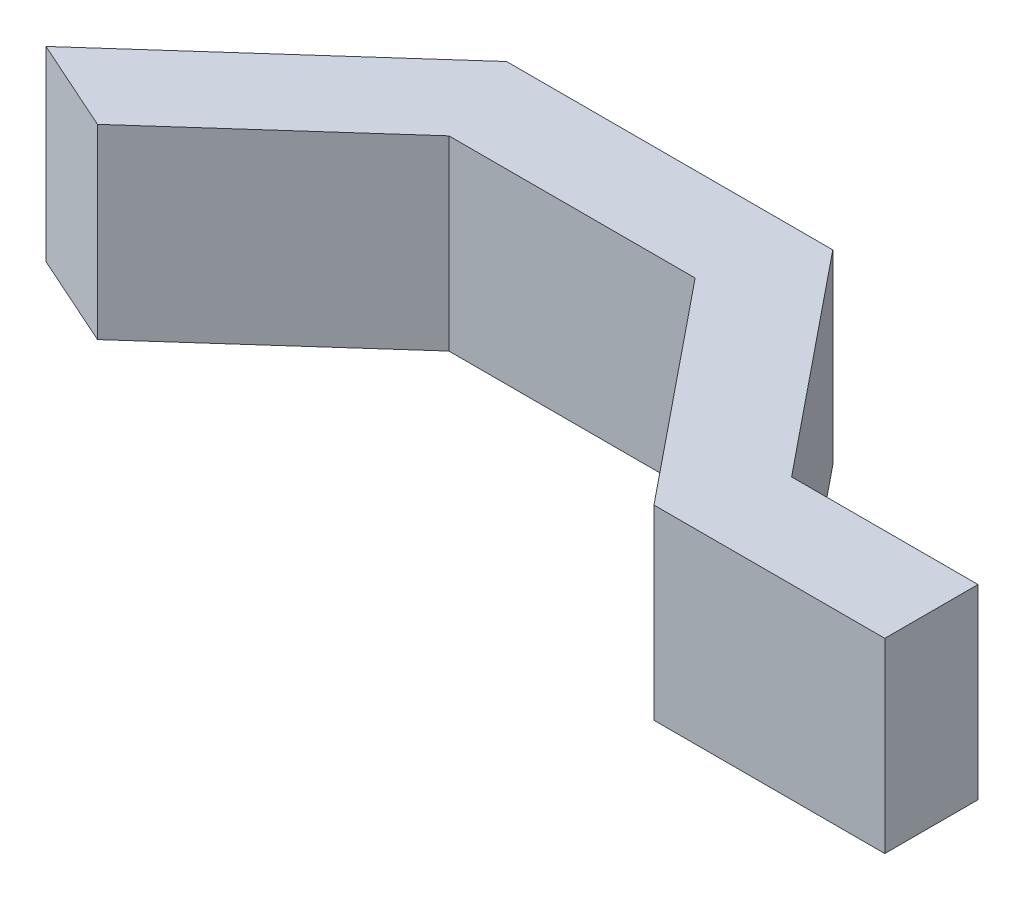
ISO-10303-21;
HEADER;
FILE_DESCRIPTION(('STEP AP214'),'2;1');
FILE_NAME('part.step','',(''),(''),'','','');
FILE_SCHEMA(('AUTOMOTIVE_DESIGN { 1 0 10303 214 1 1 1 1 }'));
ENDSEC;
DATA;
#1=APPLICATION_CONTEXT('core data for automotive mechanical design processes');
#2=APPLICATION_PROTOCOL_DEFINITION('international standard','automotive_design',2000,#1);
#3=PRODUCT_CONTEXT('',#1,'mechanical');
#4=PRODUCT('Part','Part','',(#3));
#5=PRODUCT_RELATED_PRODUCT_CATEGORY('part','',(#4));
#6=PRODUCT_DEFINITION_FORMATION('','',#4);
#7=PRODUCT_DEFINITION_CONTEXT('part definition',#1,'design');
#8=PRODUCT_DEFINITION('design','',#6,#7);
#9=PRODUCT_DEFINITION_SHAPE('','',#8);
#10=(LENGTH_UNIT() NAMED_UNIT(*) SI_UNIT(.MILLI.,.METRE.));
#11=(NAMED_UNIT(*) PLANE_ANGLE_UNIT() SI_UNIT($,.RADIAN.));
#12=(NAMED_UNIT(*) SI_UNIT($,.STERADIAN.) SOLID_ANGLE_UNIT());
#13=UNCERTAINTY_MEASURE_WITH_UNIT(LENGTH_MEASURE(1.E-05),#10,'distance_accuracy_value','');
#14=(GEOMETRIC_REPRESENTATION_CONTEXT(3) GLOBAL_UNCERTAINTY_ASSIGNED_CONTEXT((#13)) GLOBAL_UNIT_ASSIGNED_CONTEXT((#10,
#11,#12)) REPRESENTATION_CONTEXT('',''));
#15=CARTESIAN_POINT('',(0.,0.,0.));
#16=DIRECTION('',(0.,0.,1.));
#17=DIRECTION('',(1.,0.,0.));
#18=AXIS2_PLACEMENT_3D('',#15,#16,#17);
#19=CARTESIAN_POINT('',(-51.374196062884,-10.01,-7.60192675795078));
#20=DIRECTION('',(-0.408711157303925,0.,0.912663787982894));
#21=DIRECTION('',(0.912663787982894,0.,0.408711157303925));
#22=AXIS2_PLACEMENT_3D('',#19,#20,#21);
#23=PLANE('',#22);
#24=DIRECTION('',(0.,1.,0.));
#25=VECTOR('',#24,1.);
#26=CARTESIAN_POINT('',(-51.374196062884,-10.,-7.60192675795078));
#27=LINE('',#26,#25);
#28=CARTESIAN_POINT('',(-51.374196062884,-10.,-7.60192675795078));
#29=VERTEX_POINT('',#28);
#30=CARTESIAN_POINT('',(-51.374196062884,10.,-7.60192675795078));
#31=VERTEX_POINT('',#30);
#32=EDGE_CURVE('E141',#29,#31,#27,.T.);
#33=ORIENTED_EDGE('',*,*,#32,.F.);
#34=DIRECTION('',(0.912663787982894,0.,0.408711157303925));
#35=VECTOR('',#34,1.);
#36=CARTESIAN_POINT('',(-5.74615347938707,-10.,12.8313262486464));
#37=LINE('',#36,#35);
#38=CARTESIAN_POINT('',(-41.374196062884,-10.,-3.12370418918611));
#39=VERTEX_POINT('',#38);
#40=EDGE_CURVE('E142',#29,#39,#37,.T.);
#41=ORIENTED_EDGE('',*,*,#40,.T.);
#42=DIRECTION('',(0.,1.,0.));
#43=VECTOR('',#42,1.);
#44=CARTESIAN_POINT('',(-41.374196062884,-10.,-3.12370418918611));
#45=LINE('',#44,#43);
#46=CARTESIAN_POINT('',(-41.374196062884,10.,-3.12370418918611));
#47=VERTEX_POINT('',#46);
#48=EDGE_CURVE('E48',#39,#47,#45,.T.);
#49=ORIENTED_EDGE('',*,*,#48,.T.);
#50=DIRECTION('',(0.912663787982894,0.,0.408711157303925));
#51=VECTOR('',#50,1.);
#52=CARTESIAN_POINT('',(-5.74615347938707,10.,12.8313262486464));
#53=LINE('',#52,#51);
#54=EDGE_CURVE('E135',#31,#47,#53,.T.);
#55=ORIENTED_EDGE('',*,*,#54,.F.);
#56=EDGE_LOOP('',(#33,#41,#49,#55));
#57=FACE_BOUND('',#56,.T.);
#58=ADVANCED_FACE('F44',(#57),#23,.T.);
#59=CARTESIAN_POINT('',(45.625803937116,-6.,-2.6019267579508));
#60=DIRECTION('',(0.,-1.,0.));
#61=DIRECTION('',(0.,0.,-1.));
#62=AXIS2_PLACEMENT_3D('',#59,#60,#61);
#63=PLANE('',#62);
#64=CARTESIAN_POINT('',(45.625803937116,-6.,-2.6019267579508));
#65=DIRECTION('',(0.,-1.,0.));
#66=DIRECTION('',(0.,0.,-1.));
#67=AXIS2_PLACEMENT_3D('',#64,#65,#66);
#68=CIRCLE('',#67,2.5);
#69=CARTESIAN_POINT('',(45.625803937116,-6.,-5.1019267579508));
#70=VERTEX_POINT('',#69);
#71=EDGE_CURVE('E54',#70,#70,#68,.T.);
#72=ORIENTED_EDGE('',*,*,#71,.T.);
#73=EDGE_LOOP('',(#72));
#74=FACE_BOUND('',#73,.T.);
#75=ADVANCED_FACE('F275',(#74),#63,.T.);
#76=CARTESIAN_POINT('',(0.,-10.,-30.9087900506208));
#77=DIRECTION('',(0.,0.,-1.));
#78=DIRECTION('',(-1.,0.,0.));
#79=AXIS2_PLACEMENT_3D('',#76,#77,#78);
#80=PLANE('',#79);
#81=DIRECTION('',(0.,1.,0.));
#82=VECTOR('',#81,1.);
#83=CARTESIAN_POINT('',(-25.2630849517729,-10.,-30.9087900506208));
#84=LINE('',#83,#82);
#85=CARTESIAN_POINT('',(-25.2630849517729,-10.,-30.9087900506208));
#86=VERTEX_POINT('',#85);
#87=CARTESIAN_POINT('',(-25.2630849517729,10.,-30.9087900506208));
#88=VERTEX_POINT('',#87);
#89=EDGE_CURVE('E151',#86,#88,#84,.T.);
#90=ORIENTED_EDGE('',*,*,#89,.T.);
#91=DIRECTION('',(-1.,0.,0.));
#92=VECTOR('',#91,1.);
#93=CARTESIAN_POINT('',(0.,10.,-30.9087900506208));
#94=LINE('',#93,#92);
#95=CARTESIAN_POINT('',(9.73691504822712,10.,-30.9087900506208));
#96=VERTEX_POINT('',#95);
#97=EDGE_CURVE('E177',#96,#88,#94,.T.);
#98=ORIENTED_EDGE('',*,*,#97,.F.);
#99=DIRECTION('',(0.,1.,0.));
#100=VECTOR('',#99,1.);
#101=CARTESIAN_POINT('',(9.73691504822712,-10.,-30.9087900506208));
#102=LINE('',#101,#100);
#103=CARTESIAN_POINT('',(9.73691504822712,-10.,-30.9087900506208));
#104=VERTEX_POINT('',#103);
#105=EDGE_CURVE('E217',#104,#96,#102,.T.);
#106=ORIENTED_EDGE('',*,*,#105,.F.);
#107=DIRECTION('',(-1.,0.,0.));
#108=VECTOR('',#107,1.);
#109=CARTESIAN_POINT('',(0.,-10.,-30.9087900506208));
#110=LINE('',#109,#108);
#111=EDGE_CURVE('E207',#104,#86,#110,.T.);
#112=ORIENTED_EDGE('',*,*,#111,.T.);
#113=EDGE_LOOP('',(#90,#98,#106,#112));
#114=FACE_BOUND('',#113,.T.);
#115=ADVANCED_FACE('F261',(#114),#80,.T.);
#116=CARTESIAN_POINT('',(20.9961081869277,-10.,-17.0161531245904));
#117=DIRECTION('',(0.776895443089001,0.,-0.62962962962963));
#118=DIRECTION('',(-0.62962962962963,0.,-0.776895443089001));
#119=AXIS2_PLACEMENT_3D('',#116,#117,#118);
#120=PLANE('',#119);
#121=ORIENTED_EDGE('',*,*,#105,.T.);
#122=DIRECTION('',(-0.62962962962963,0.,-0.776895443089001));
#123=VECTOR('',#122,1.);
#124=CARTESIAN_POINT('',(20.9961081869277,10.,-17.0161531245904));
#125=LINE('',#124,#123);
#126=CARTESIAN_POINT('',(28.625803937116,10.,-7.6019267579508));
#127=VERTEX_POINT('',#126);
#128=EDGE_CURVE('E173',#127,#96,#125,.T.);
#129=ORIENTED_EDGE('',*,*,#128,.F.);
#130=DIRECTION('',(0.,1.,0.));
#131=VECTOR('',#130,1.);
#132=CARTESIAN_POINT('',(28.625803937116,-10.,-7.6019267579508));
#133=LINE('',#132,#131);
#134=CARTESIAN_POINT('',(28.625803937116,-10.,-7.6019267579508));
#135=VERTEX_POINT('',#134);
#136=EDGE_CURVE('E220',#135,#127,#133,.T.);
#137=ORIENTED_EDGE('',*,*,#136,.F.);
#138=DIRECTION('',(-0.62962962962963,0.,-0.776895443089001));
#139=VECTOR('',#138,1.);
#140=CARTESIAN_POINT('',(20.9961081869277,-10.,-17.0161531245904));
#141=LINE('',#140,#139);
#142=EDGE_CURVE('E203',#135,#104,#141,.T.);
#143=ORIENTED_EDGE('',*,*,#142,.T.);
#144=EDGE_LOOP('',(#121,#129,#137,#143));
#145=FACE_BOUND('',#144,.T.);
#146=ADVANCED_FACE('F258',(#145),#120,.T.);
#147=CARTESIAN_POINT('',(0.,-10.,-7.6019267579508));
#148=DIRECTION('',(0.,0.,-1.));
#149=DIRECTION('',(-1.,0.,0.));
#150=AXIS2_PLACEMENT_3D('',#147,#148,#149);
#151=PLANE('',#150);
#152=ORIENTED_EDGE('',*,*,#136,.T.);
#153=DIRECTION('',(-1.,0.,0.));
#154=VECTOR('',#153,1.);
#155=CARTESIAN_POINT('',(0.,10.,-7.6019267579508));
#156=LINE('',#155,#154);
#157=CARTESIAN_POINT('',(48.625803937116,10.,-7.6019267579508));
#158=VERTEX_POINT('',#157);
#159=EDGE_CURVE('E169',#158,#127,#156,.T.);
#160=ORIENTED_EDGE('',*,*,#159,.F.);
#161=DIRECTION('',(0.,1.,0.));
#162=VECTOR('',#161,1.);
#163=CARTESIAN_POINT('',(48.625803937116,-10.,-7.6019267579508));
#164=LINE('',#163,#162);
#165=CARTESIAN_POINT('',(48.625803937116,-10.,-7.6019267579508));
#166=VERTEX_POINT('',#165);
#167=EDGE_CURVE('E223',#166,#158,#164,.T.);
#168=ORIENTED_EDGE('',*,*,#167,.F.);
#169=DIRECTION('',(-1.,0.,0.));
#170=VECTOR('',#169,1.);
#171=CARTESIAN_POINT('',(0.,-10.,-7.6019267579508));
#172=LINE('',#171,#170);
#173=EDGE_CURVE('E199',#166,#135,#172,.T.);
#174=ORIENTED_EDGE('',*,*,#173,.T.);
#175=EDGE_LOOP('',(#152,#160,#168,#174));
#176=FACE_BOUND('',#175,.T.);
#177=ADVANCED_FACE('F256',(#176),#151,.T.);
#178=CARTESIAN_POINT('',(48.625803937116,-10.,0.));
#179=DIRECTION('',(1.,0.,0.));
#180=DIRECTION('',(0.,0.,-1.));
#181=AXIS2_PLACEMENT_3D('',#178,#179,#180);
#182=PLANE('',#181);
#183=ORIENTED_EDGE('',*,*,#167,.T.);
#184=DIRECTION('',(0.,0.,-1.));
#185=VECTOR('',#184,1.);
#186=CARTESIAN_POINT('',(48.625803937116,10.,0.));
#187=LINE('',#186,#185);
#188=CARTESIAN_POINT('',(48.625803937116,10.,2.3980732420492));
#189=VERTEX_POINT('',#188);
#190=EDGE_CURVE('E165',#189,#158,#187,.T.);
#191=ORIENTED_EDGE('',*,*,#190,.F.);
#192=DIRECTION('',(0.,1.,0.));
#193=VECTOR('',#192,1.);
#194=CARTESIAN_POINT('',(48.625803937116,-10.,2.3980732420492));
#195=LINE('',#194,#193);
#196=CARTESIAN_POINT('',(48.625803937116,-10.,2.3980732420492));
#197=VERTEX_POINT('',#196);
#198=EDGE_CURVE('E226',#197,#189,#195,.T.);
#199=ORIENTED_EDGE('',*,*,#198,.F.);
#200=DIRECTION('',(0.,0.,-1.));
#201=VECTOR('',#200,1.);
#202=CARTESIAN_POINT('',(48.625803937116,-10.,0.));
#203=LINE('',#202,#201);
#204=EDGE_CURVE('E195',#197,#166,#203,.T.);
#205=ORIENTED_EDGE('',*,*,#204,.T.);
#206=EDGE_LOOP('',(#183,#191,#199,#205));
#207=FACE_BOUND('',#206,.T.);
#208=ADVANCED_FACE('F252',(#207),#182,.T.);
#209=CARTESIAN_POINT('',(0.,-10.,2.3980732420492));
#210=DIRECTION('',(0.,0.,1.));
#211=DIRECTION('',(1.,0.,0.));
#212=AXIS2_PLACEMENT_3D('',#209,#210,#211);
#213=PLANE('',#212);
#214=ORIENTED_EDGE('',*,*,#198,.T.);
#215=DIRECTION('',(1.,0.,0.));
#216=VECTOR('',#215,1.);
#217=CARTESIAN_POINT('',(0.,10.,2.3980732420492));
#218=LINE('',#217,#216);
#219=CARTESIAN_POINT('',(23.8584909908881,10.,2.3980732420492));
#220=VERTEX_POINT('',#219);
#221=EDGE_CURVE('E161',#220,#189,#218,.T.);
#222=ORIENTED_EDGE('',*,*,#221,.F.);
#223=DIRECTION('',(0.,1.,0.));
#224=VECTOR('',#223,1.);
#225=CARTESIAN_POINT('',(23.8584909908881,-10.,2.3980732420492));
#226=LINE('',#225,#224);
#227=CARTESIAN_POINT('',(23.8584909908881,-10.,2.3980732420492));
#228=VERTEX_POINT('',#227);
#229=EDGE_CURVE('E229',#228,#220,#226,.T.);
#230=ORIENTED_EDGE('',*,*,#229,.F.);
#231=DIRECTION('',(1.,0.,0.));
#232=VECTOR('',#231,1.);
#233=CARTESIAN_POINT('',(0.,-10.,2.3980732420492));
#234=LINE('',#233,#232);
#235=EDGE_CURVE('E191',#228,#197,#234,.T.);
#236=ORIENTED_EDGE('',*,*,#235,.T.);
#237=EDGE_LOOP('',(#214,#222,#230,#236));
#238=FACE_BOUND('',#237,.T.);
#239=ADVANCED_FACE('F242',(#238),#213,.T.);
#240=CARTESIAN_POINT('',(13.2271537560377,-10.,-10.7198568282941));
#241=DIRECTION('',(0.776895443089001,0.,-0.62962962962963));
#242=DIRECTION('',(-0.62962962962963,0.,-0.776895443089001));
#243=AXIS2_PLACEMENT_3D('',#240,#241,#242);
#244=PLANE('',#243);
#245=ORIENTED_EDGE('',*,*,#229,.T.);
#246=DIRECTION('',(-0.62962962962963,0.,-0.776895443089001));
#247=VECTOR('',#246,1.);
#248=CARTESIAN_POINT('',(13.2271537560377,10.,-10.7198568282941));
#249=LINE('',#248,#247);
#250=CARTESIAN_POINT('',(4.96960210199915,10.,-20.9087900506208));
#251=VERTEX_POINT('',#250);
#252=EDGE_CURVE('E157',#220,#251,#249,.T.);
#253=ORIENTED_EDGE('',*,*,#252,.T.);
#254=DIRECTION('',(0.,1.,0.));
#255=VECTOR('',#254,1.);
#256=CARTESIAN_POINT('',(4.96960210199915,-10.,-20.9087900506208));
#257=LINE('',#256,#255);
#258=CARTESIAN_POINT('',(4.96960210199915,-10.,-20.9087900506208));
#259=VERTEX_POINT('',#258);
#260=EDGE_CURVE('E70',#259,#251,#257,.T.);
#261=ORIENTED_EDGE('',*,*,#260,.F.);
#262=DIRECTION('',(-0.62962962962963,0.,-0.776895443089001));
#263=VECTOR('',#262,1.);
#264=CARTESIAN_POINT('',(13.2271537560377,-10.,-10.7198568282941));
#265=LINE('',#264,#263);
#266=EDGE_CURVE('E188',#228,#259,#265,.T.);
#267=ORIENTED_EDGE('',*,*,#266,.F.);
#268=EDGE_LOOP('',(#245,#253,#261,#267));
#269=FACE_BOUND('',#268,.T.);
#270=ADVANCED_FACE('F238',(#269),#244,.F.);
#271=CARTESIAN_POINT('',(0.,-10.,-20.9087900506208));
#272=DIRECTION('',(0.,0.,-1.));
#273=DIRECTION('',(-1.,0.,0.));
#274=AXIS2_PLACEMENT_3D('',#271,#272,#273);
#275=PLANE('',#274);
#276=ORIENTED_EDGE('',*,*,#260,.T.);
#277=DIRECTION('',(-1.,0.,0.));
#278=VECTOR('',#277,1.);
#279=CARTESIAN_POINT('',(0.,10.,-20.9087900506208));
#280=LINE('',#279,#278);
#281=CARTESIAN_POINT('',(-21.4492345947905,10.,-20.9087900506208));
#282=VERTEX_POINT('',#281);
#283=EDGE_CURVE('E131',#251,#282,#280,.T.);
#284=ORIENTED_EDGE('',*,*,#283,.T.);
#285=DIRECTION('',(0.,1.,0.));
#286=VECTOR('',#285,1.);
#287=CARTESIAN_POINT('',(-21.4492345947905,-10.,-20.9087900506208));
#288=LINE('',#287,#286);
#289=CARTESIAN_POINT('',(-21.4492345947905,-10.,-20.9087900506208));
#290=VERTEX_POINT('',#289);
#291=EDGE_CURVE('E62',#290,#282,#288,.T.);
#292=ORIENTED_EDGE('',*,*,#291,.F.);
#293=DIRECTION('',(-1.,0.,0.));
#294=VECTOR('',#293,1.);
#295=CARTESIAN_POINT('',(0.,-10.,-20.9087900506208));
#296=LINE('',#295,#294);
#297=EDGE_CURVE('E185',#259,#290,#296,.T.);
#298=ORIENTED_EDGE('',*,*,#297,.F.);
#299=EDGE_LOOP('',(#276,#284,#292,#298));
#300=FACE_BOUND('',#299,.T.);
#301=ADVANCED_FACE('F244',(#300),#275,.F.);
#302=CARTESIAN_POINT('',(-19.8986601221776,-10.,-22.2928379030661));
#303=DIRECTION('',(-0.665910379790572,0.,-0.746031746031746));
#304=DIRECTION('',(-0.746031746031746,0.,0.665910379790572));
#305=AXIS2_PLACEMENT_3D('',#302,#303,#304);
#306=PLANE('',#305);
#307=ORIENTED_EDGE('',*,*,#291,.T.);
#308=DIRECTION('',(-0.746031746031746,0.,0.665910379790572));
#309=VECTOR('',#308,1.);
#310=CARTESIAN_POINT('',(-19.8986601221776,10.,-22.2928379030661));
#311=LINE('',#310,#309);
#312=EDGE_CURVE('E125',#282,#47,#311,.T.);
#313=ORIENTED_EDGE('',*,*,#312,.T.);
#314=ORIENTED_EDGE('',*,*,#48,.F.);
#315=DIRECTION('',(-0.746031746031746,0.,0.665910379790572));
#316=VECTOR('',#315,1.);
#317=CARTESIAN_POINT('',(-19.8986601221776,-10.,-22.2928379030661));
#318=LINE('',#317,#316);
#319=EDGE_CURVE('E182',#290,#39,#318,.T.);
#320=ORIENTED_EDGE('',*,*,#319,.F.);
#321=EDGE_LOOP('',(#307,#313,#314,#320));
#322=FACE_BOUND('',#321,.T.);
#323=ADVANCED_FACE('F127',(#322),#306,.F.);
#324=CARTESIAN_POINT('',(-26.5577639200833,-10.,-29.7531553633836));
#325=DIRECTION('',(-0.665910379790572,0.,-0.746031746031746));
#326=DIRECTION('',(-0.746031746031746,0.,0.665910379790572));
#327=AXIS2_PLACEMENT_3D('',#324,#325,#326);
#328=PLANE('',#327);
#329=ORIENTED_EDGE('',*,*,#32,.T.);
#330=DIRECTION('',(-0.746031746031746,0.,0.665910379790572));
#331=VECTOR('',#330,1.);
#332=CARTESIAN_POINT('',(-26.5577639200833,10.,-29.7531553633836));
#333=LINE('',#332,#331);
#334=EDGE_CURVE('E138',#88,#31,#333,.T.);
#335=ORIENTED_EDGE('',*,*,#334,.F.);
#336=ORIENTED_EDGE('',*,*,#89,.F.);
#337=DIRECTION('',(-0.746031746031746,0.,0.665910379790572));
#338=VECTOR('',#337,1.);
#339=CARTESIAN_POINT('',(-26.5577639200833,-10.,-29.7531553633836));
#340=LINE('',#339,#338);
#341=EDGE_CURVE('E211',#86,#29,#340,.T.);
#342=ORIENTED_EDGE('',*,*,#341,.T.);
#343=EDGE_LOOP('',(#329,#335,#336,#342));
#344=FACE_BOUND('',#343,.T.);
#345=ADVANCED_FACE('F264',(#344),#328,.T.);
#346=CARTESIAN_POINT('',(0.,10.,0.));
#347=DIRECTION('',(0.,1.,0.));
#348=DIRECTION('',(0.,0.,1.));
#349=AXIS2_PLACEMENT_3D('',#346,#347,#348);
#350=PLANE('',#349);
#351=ORIENTED_EDGE('',*,*,#334,.T.);
#352=ORIENTED_EDGE('',*,*,#54,.T.);
#353=ORIENTED_EDGE('',*,*,#312,.F.);
#354=ORIENTED_EDGE('',*,*,#283,.F.);
#355=ORIENTED_EDGE('',*,*,#252,.F.);
#356=ORIENTED_EDGE('',*,*,#221,.T.);
#357=ORIENTED_EDGE('',*,*,#190,.T.);
#358=ORIENTED_EDGE('',*,*,#159,.T.);
#359=ORIENTED_EDGE('',*,*,#128,.T.);
#360=ORIENTED_EDGE('',*,*,#97,.T.);
#361=EDGE_LOOP('',(#351,#352,#353,#354,#355,#356,#357,#358,#359,#360));
#362=FACE_BOUND('',#361,.T.);
#363=ADVANCED_FACE('F46',(#362),#350,.T.);
#364=CARTESIAN_POINT('',(45.625803937116,-6.,-2.6019267579508));
#365=DIRECTION('',(0.,-1.,0.));
#366=DIRECTION('',(0.,0.,-1.));
#367=AXIS2_PLACEMENT_3D('',#364,#365,#366);
#368=CYLINDRICAL_SURFACE('',#367,2.5);
#369=ORIENTED_EDGE('',*,*,#71,.F.);
#370=EDGE_LOOP('',(#369));
#371=FACE_BOUND('',#370,.T.);
#372=CARTESIAN_POINT('',(45.625803937116,-10.,-2.6019267579508));
#373=DIRECTION('',(0.,-1.,0.));
#374=DIRECTION('',(0.,0.,-1.));
#375=AXIS2_PLACEMENT_3D('',#372,#373,#374);
#376=CIRCLE('',#375,2.5);
#377=CARTESIAN_POINT('',(45.625803937116,-10.,-5.1019267579508));
#378=VERTEX_POINT('',#377);
#379=EDGE_CURVE('E11',#378,#378,#376,.T.);
#380=ORIENTED_EDGE('',*,*,#379,.T.);
#381=EDGE_LOOP('',(#380));
#382=FACE_BOUND('',#381,.T.);
#383=ADVANCED_FACE('F271',(#371,#382),#368,.F.);
#384=CARTESIAN_POINT('',(0.,-10.,0.));
#385=DIRECTION('',(0.,1.,0.));
#386=DIRECTION('',(0.,0.,1.));
#387=AXIS2_PLACEMENT_3D('',#384,#385,#386);
#388=PLANE('',#387);
#389=ORIENTED_EDGE('',*,*,#379,.F.);
#390=EDGE_LOOP('',(#389));
#391=FACE_BOUND('',#390,.T.);
#392=ORIENTED_EDGE('',*,*,#40,.F.);
#393=ORIENTED_EDGE('',*,*,#341,.F.);
#394=ORIENTED_EDGE('',*,*,#111,.F.);
#395=ORIENTED_EDGE('',*,*,#142,.F.);
#396=ORIENTED_EDGE('',*,*,#173,.F.);
#397=ORIENTED_EDGE('',*,*,#204,.F.);
#398=ORIENTED_EDGE('',*,*,#235,.F.);
#399=ORIENTED_EDGE('',*,*,#266,.T.);
#400=ORIENTED_EDGE('',*,*,#297,.T.);
#401=ORIENTED_EDGE('',*,*,#319,.T.);
#402=EDGE_LOOP('',(#392,#393,#394,#395,#396,#397,#398,#399,#400,#401));
#403=FACE_BOUND('',#402,.T.);
#404=ADVANCED_FACE('F246',(#391,#403),#388,.F.);
#405=CLOSED_SHELL('',(#58,#75,#115,#146,#177,#208,#239,#270,#301,#323,#345,#363,#383,#404));
#406=MANIFOLD_SOLID_BREP('B2',#405);
#407=ADVANCED_BREP_SHAPE_REPRESENTATION('',(#18,#406),#14);
#408=SHAPE_DEFINITION_REPRESENTATION(#9,#407);
ENDSEC;
END-ISO-10303-21;
